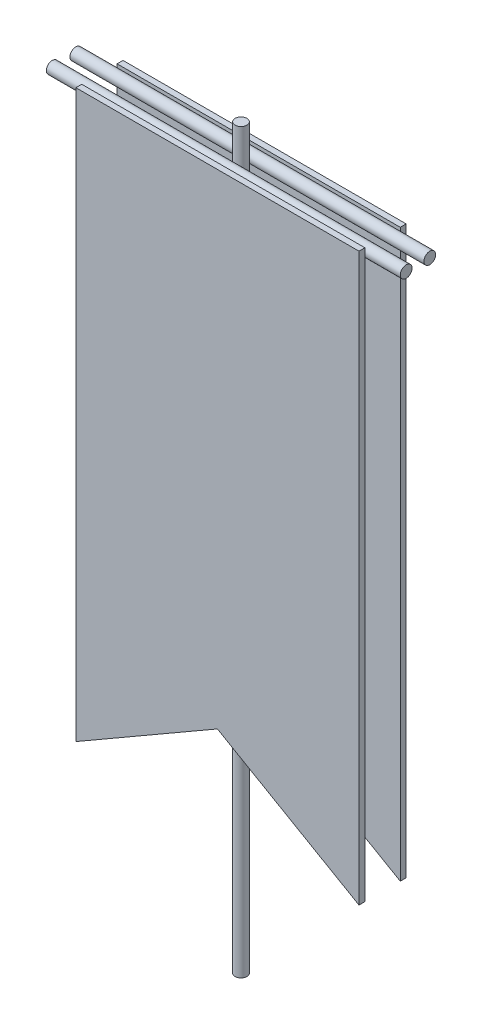
ISO-10303-21;
HEADER;
FILE_DESCRIPTION(('STEP AP214'),'2;1');
FILE_NAME('part.step','',(''),(''),'','','');
FILE_SCHEMA(('AUTOMOTIVE_DESIGN { 1 0 10303 214 1 1 1 1 }'));
ENDSEC;
DATA;
#1=APPLICATION_CONTEXT('core data for automotive mechanical design processes');
#2=APPLICATION_PROTOCOL_DEFINITION('international standard','automotive_design',2000,#1);
#3=PRODUCT_CONTEXT('',#1,'mechanical');
#4=PRODUCT('Part','Part','',(#3));
#5=PRODUCT_RELATED_PRODUCT_CATEGORY('part','',(#4));
#6=PRODUCT_DEFINITION_FORMATION('','',#4);
#7=PRODUCT_DEFINITION_CONTEXT('part definition',#1,'design');
#8=PRODUCT_DEFINITION('design','',#6,#7);
#9=PRODUCT_DEFINITION_SHAPE('','',#8);
#10=(LENGTH_UNIT() NAMED_UNIT(*) SI_UNIT(.MILLI.,.METRE.));
#11=(NAMED_UNIT(*) PLANE_ANGLE_UNIT() SI_UNIT($,.RADIAN.));
#12=(NAMED_UNIT(*) SI_UNIT($,.STERADIAN.) SOLID_ANGLE_UNIT());
#13=UNCERTAINTY_MEASURE_WITH_UNIT(LENGTH_MEASURE(1.E-05),#10,'distance_accuracy_value','');
#14=(GEOMETRIC_REPRESENTATION_CONTEXT(3) GLOBAL_UNCERTAINTY_ASSIGNED_CONTEXT((#13)) GLOBAL_UNIT_ASSIGNED_CONTEXT((#10,
#11,#12)) REPRESENTATION_CONTEXT('',''));
#15=CARTESIAN_POINT('',(0.,0.,0.));
#16=DIRECTION('',(0.,0.,1.));
#17=DIRECTION('',(1.,0.,0.));
#18=AXIS2_PLACEMENT_3D('',#15,#16,#17);
#19=CARTESIAN_POINT('',(0.,641.35,0.));
#20=DIRECTION('',(0.,1.,0.));
#21=DIRECTION('',(0.,0.,1.));
#22=AXIS2_PLACEMENT_3D('',#19,#20,#21);
#23=PLANE('',#22);
#24=CARTESIAN_POINT('',(0.,641.35,0.));
#25=DIRECTION('',(0.,1.,0.));
#26=DIRECTION('',(0.,0.,1.));
#27=AXIS2_PLACEMENT_3D('',#24,#25,#26);
#28=CIRCLE('',#27,6.35);
#29=CARTESIAN_POINT('',(0.,641.35,6.35));
#30=VERTEX_POINT('',#29);
#31=EDGE_CURVE('P0_E18',#30,#30,#28,.F.);
#32=ORIENTED_EDGE('',*,*,#31,.F.);
#33=EDGE_LOOP('',(#32));
#34=FACE_BOUND('',#33,.T.);
#35=ADVANCED_FACE('P0_F15',(#34),#23,.T.);
#36=CARTESIAN_POINT('',(0.,-152.4,0.));
#37=DIRECTION('',(0.,-1.,0.));
#38=DIRECTION('',(0.,0.,-1.));
#39=AXIS2_PLACEMENT_3D('',#36,#37,#38);
#40=PLANE('',#39);
#41=CARTESIAN_POINT('',(0.,-152.4,0.));
#42=DIRECTION('',(0.,1.,0.));
#43=DIRECTION('',(0.,0.,1.));
#44=AXIS2_PLACEMENT_3D('',#41,#42,#43);
#45=CIRCLE('',#44,6.35);
#46=CARTESIAN_POINT('',(0.,-152.4,6.35));
#47=VERTEX_POINT('',#46);
#48=EDGE_CURVE('P0_E10',#47,#47,#45,.T.);
#49=ORIENTED_EDGE('',*,*,#48,.F.);
#50=EDGE_LOOP('',(#49));
#51=FACE_BOUND('',#50,.T.);
#52=ADVANCED_FACE('P0_F30',(#51),#40,.T.);
#53=CARTESIAN_POINT('',(0.,0.,0.));
#54=DIRECTION('',(0.,1.,0.));
#55=DIRECTION('',(0.,0.,1.));
#56=AXIS2_PLACEMENT_3D('',#53,#54,#55);
#57=CYLINDRICAL_SURFACE('',#56,6.35);
#58=ORIENTED_EDGE('',*,*,#48,.T.);
#59=EDGE_LOOP('',(#58));
#60=FACE_BOUND('',#59,.T.);
#61=ORIENTED_EDGE('',*,*,#31,.T.);
#62=EDGE_LOOP('',(#61));
#63=FACE_BOUND('',#62,.T.);
#64=ADVANCED_FACE('P0_F27',(#60,#63),#57,.T.);
#65=CLOSED_SHELL('',(#35,#52,#64));
#66=MANIFOLD_SOLID_BREP('P0_B1',#65);
#67=CARTESIAN_POINT('',(0.,0.,-25.4));
#68=DIRECTION('',(0.,0.,1.));
#69=DIRECTION('',(1.,0.,0.));
#70=AXIS2_PLACEMENT_3D('',#67,#68,#69);
#71=PLANE('',#70);
#72=DIRECTION('',(1.,0.,0.));
#73=VECTOR('',#72,1.);
#74=CARTESIAN_POINT('',(0.,609.6,-25.4));
#75=LINE('',#74,#73);
#76=CARTESIAN_POINT('',(-152.4,609.6,-25.4));
#77=VERTEX_POINT('',#76);
#78=CARTESIAN_POINT('',(152.4,609.6,-25.4));
#79=VERTEX_POINT('',#78);
#80=EDGE_CURVE('P1_E62',#77,#79,#75,.T.);
#81=ORIENTED_EDGE('',*,*,#80,.T.);
#82=DIRECTION('',(0.,1.,0.));
#83=VECTOR('',#82,1.);
#84=CARTESIAN_POINT('',(152.4,0.,-25.4));
#85=LINE('',#84,#83);
#86=CARTESIAN_POINT('',(152.4,4.33680868994202E-13,-25.4));
#87=VERTEX_POINT('',#86);
#88=EDGE_CURVE('P1_E64',#79,#87,#85,.F.);
#89=ORIENTED_EDGE('',*,*,#88,.T.);
#90=DIRECTION('',(-0.866025403784429,0.500000000000017,0.));
#91=VECTOR('',#90,1.);
#92=CARTESIAN_POINT('',(0.,87.9881810245052,-25.4));
#93=LINE('',#92,#91);
#94=CARTESIAN_POINT('',(2.4447980567411E-13,87.9881810245048,-25.4));
#95=VERTEX_POINT('',#94);
#96=EDGE_CURVE('P1_E20',#87,#95,#93,.T.);
#97=ORIENTED_EDGE('',*,*,#96,.T.);
#98=DIRECTION('',(-0.866025403784429,-0.500000000000017,0.));
#99=VECTOR('',#98,1.);
#100=CARTESIAN_POINT('',(-152.4,0.,-25.4));
#101=LINE('',#100,#99);
#102=CARTESIAN_POINT('',(-152.4,0.,-25.4));
#103=VERTEX_POINT('',#102);
#104=EDGE_CURVE('P1_E92',#95,#103,#101,.T.);
#105=ORIENTED_EDGE('',*,*,#104,.T.);
#106=DIRECTION('',(0.,1.,0.));
#107=VECTOR('',#106,1.);
#108=CARTESIAN_POINT('',(-152.4,609.6,-25.4));
#109=LINE('',#108,#107);
#110=EDGE_CURVE('P1_E86',#103,#77,#109,.T.);
#111=ORIENTED_EDGE('',*,*,#110,.T.);
#112=EDGE_LOOP('',(#81,#89,#97,#105,#111));
#113=FACE_BOUND('',#112,.T.);
#114=ADVANCED_FACE('P1_F17',(#113),#71,.F.);
#115=CARTESIAN_POINT('',(0.,87.9881810245052,-19.05));
#116=DIRECTION('',(0.500000000000017,0.866025403784429,0.));
#117=DIRECTION('',(-0.866025403784429,0.500000000000017,0.));
#118=AXIS2_PLACEMENT_3D('',#115,#116,#117);
#119=PLANE('',#118);
#120=ORIENTED_EDGE('',*,*,#96,.F.);
#121=DIRECTION('',(0.,0.,1.));
#122=VECTOR('',#121,1.);
#123=CARTESIAN_POINT('',(152.4,0.,-19.05));
#124=LINE('',#123,#122);
#125=CARTESIAN_POINT('',(152.4,8.67361737988404E-13,-19.05));
#126=VERTEX_POINT('',#125);
#127=EDGE_CURVE('P1_E70',#87,#126,#124,.T.);
#128=ORIENTED_EDGE('',*,*,#127,.T.);
#129=DIRECTION('',(0.866025403784423,-0.500000000000027,0.));
#130=VECTOR('',#129,1.);
#131=CARTESIAN_POINT('',(0.,87.9881810245052,-19.05));
#132=LINE('',#131,#130);
#133=CARTESIAN_POINT('',(2.4980018054066E-13,87.9881810245048,-19.05));
#134=VERTEX_POINT('',#133);
#135=EDGE_CURVE('P1_E95',#134,#126,#132,.T.);
#136=ORIENTED_EDGE('',*,*,#135,.F.);
#137=DIRECTION('',(0.,0.,1.));
#138=VECTOR('',#137,1.);
#139=CARTESIAN_POINT('',(9.99200722162641E-13,87.9881810245035,-19.05));
#140=LINE('',#139,#138);
#141=EDGE_CURVE('P1_E75',#134,#95,#140,.F.);
#142=ORIENTED_EDGE('',*,*,#141,.T.);
#143=EDGE_LOOP('',(#120,#128,#136,#142));
#144=FACE_BOUND('',#143,.T.);
#145=ADVANCED_FACE('P1_F72',(#144),#119,.F.);
#146=CARTESIAN_POINT('',(152.4,0.,-19.05));
#147=DIRECTION('',(-1.,0.,0.));
#148=DIRECTION('',(0.,0.,1.));
#149=AXIS2_PLACEMENT_3D('',#146,#147,#148);
#150=PLANE('',#149);
#151=ORIENTED_EDGE('',*,*,#88,.F.);
#152=DIRECTION('',(0.,0.,-1.));
#153=VECTOR('',#152,1.);
#154=CARTESIAN_POINT('',(152.4,609.6,-19.05));
#155=LINE('',#154,#153);
#156=CARTESIAN_POINT('',(152.4,609.6,-19.05));
#157=VERTEX_POINT('',#156);
#158=EDGE_CURVE('P1_E81',#79,#157,#155,.F.);
#159=ORIENTED_EDGE('',*,*,#158,.T.);
#160=DIRECTION('',(0.,1.,0.));
#161=VECTOR('',#160,1.);
#162=CARTESIAN_POINT('',(152.4,0.,-19.05));
#163=LINE('',#162,#161);
#164=EDGE_CURVE('P1_E79',#126,#157,#163,.T.);
#165=ORIENTED_EDGE('',*,*,#164,.F.);
#166=ORIENTED_EDGE('',*,*,#127,.F.);
#167=EDGE_LOOP('',(#151,#159,#165,#166));
#168=FACE_BOUND('',#167,.T.);
#169=ADVANCED_FACE('P1_F77',(#168),#150,.F.);
#170=CARTESIAN_POINT('',(0.,609.6,-19.05));
#171=DIRECTION('',(0.,-1.,0.));
#172=DIRECTION('',(0.,0.,-1.));
#173=AXIS2_PLACEMENT_3D('',#170,#171,#172);
#174=PLANE('',#173);
#175=ORIENTED_EDGE('',*,*,#80,.F.);
#176=DIRECTION('',(0.,0.,-1.));
#177=VECTOR('',#176,1.);
#178=CARTESIAN_POINT('',(-152.4,609.6,-19.05));
#179=LINE('',#178,#177);
#180=CARTESIAN_POINT('',(-152.4,609.6,-19.05));
#181=VERTEX_POINT('',#180);
#182=EDGE_CURVE('P1_E88',#77,#181,#179,.F.);
#183=ORIENTED_EDGE('',*,*,#182,.T.);
#184=DIRECTION('',(1.,0.,0.));
#185=VECTOR('',#184,1.);
#186=CARTESIAN_POINT('',(0.,609.6,-19.05));
#187=LINE('',#186,#185);
#188=EDGE_CURVE('P1_E98',#157,#181,#187,.F.);
#189=ORIENTED_EDGE('',*,*,#188,.F.);
#190=ORIENTED_EDGE('',*,*,#158,.F.);
#191=EDGE_LOOP('',(#175,#183,#189,#190));
#192=FACE_BOUND('',#191,.T.);
#193=ADVANCED_FACE('P1_F107',(#192),#174,.F.);
#194=CARTESIAN_POINT('',(-152.4,609.6,-19.05));
#195=DIRECTION('',(1.,0.,0.));
#196=DIRECTION('',(0.,0.,-1.));
#197=AXIS2_PLACEMENT_3D('',#194,#195,#196);
#198=PLANE('',#197);
#199=ORIENTED_EDGE('',*,*,#110,.F.);
#200=DIRECTION('',(0.,0.,1.));
#201=VECTOR('',#200,1.);
#202=CARTESIAN_POINT('',(-152.4,0.,-19.05));
#203=LINE('',#202,#201);
#204=CARTESIAN_POINT('',(-152.4,0.,-19.05));
#205=VERTEX_POINT('',#204);
#206=EDGE_CURVE('P1_E35',#103,#205,#203,.T.);
#207=ORIENTED_EDGE('',*,*,#206,.T.);
#208=DIRECTION('',(0.,1.,0.));
#209=VECTOR('',#208,1.);
#210=CARTESIAN_POINT('',(-152.4,0.,-19.05));
#211=LINE('',#210,#209);
#212=EDGE_CURVE('P1_E26',#181,#205,#211,.F.);
#213=ORIENTED_EDGE('',*,*,#212,.F.);
#214=ORIENTED_EDGE('',*,*,#182,.F.);
#215=EDGE_LOOP('',(#199,#207,#213,#214));
#216=FACE_BOUND('',#215,.T.);
#217=ADVANCED_FACE('P1_F105',(#216),#198,.F.);
#218=CARTESIAN_POINT('',(-152.4,0.,-19.05));
#219=DIRECTION('',(-0.500000000000017,0.866025403784429,0.));
#220=DIRECTION('',(-0.866025403784429,-0.500000000000017,0.));
#221=AXIS2_PLACEMENT_3D('',#218,#219,#220);
#222=PLANE('',#221);
#223=ORIENTED_EDGE('',*,*,#104,.F.);
#224=ORIENTED_EDGE('',*,*,#141,.F.);
#225=DIRECTION('',(0.866025403784423,0.500000000000027,0.));
#226=VECTOR('',#225,1.);
#227=CARTESIAN_POINT('',(-152.4,0.,-19.05));
#228=LINE('',#227,#226);
#229=EDGE_CURVE('P1_E11',#205,#134,#228,.T.);
#230=ORIENTED_EDGE('',*,*,#229,.F.);
#231=ORIENTED_EDGE('',*,*,#206,.F.);
#232=EDGE_LOOP('',(#223,#224,#230,#231));
#233=FACE_BOUND('',#232,.T.);
#234=ADVANCED_FACE('P1_F109',(#233),#222,.F.);
#235=CARTESIAN_POINT('',(0.,0.,-19.05));
#236=DIRECTION('',(0.,0.,1.));
#237=DIRECTION('',(1.,0.,0.));
#238=AXIS2_PLACEMENT_3D('',#235,#236,#237);
#239=PLANE('',#238);
#240=ORIENTED_EDGE('',*,*,#212,.T.);
#241=ORIENTED_EDGE('',*,*,#229,.T.);
#242=ORIENTED_EDGE('',*,*,#135,.T.);
#243=ORIENTED_EDGE('',*,*,#164,.T.);
#244=ORIENTED_EDGE('',*,*,#188,.T.);
#245=EDGE_LOOP('',(#240,#241,#242,#243,#244));
#246=FACE_BOUND('',#245,.T.);
#247=ADVANCED_FACE('P1_F102',(#246),#239,.T.);
#248=CLOSED_SHELL('',(#114,#145,#169,#193,#217,#234,#247));
#249=MANIFOLD_SOLID_BREP('P1_B1',#248);
#250=CARTESIAN_POINT('',(190.5,0.,0.));
#251=DIRECTION('',(-1.,0.,0.));
#252=DIRECTION('',(0.,0.,1.));
#253=AXIS2_PLACEMENT_3D('',#250,#251,#252);
#254=PLANE('',#253);
#255=CARTESIAN_POINT('',(190.5,603.25,-12.7));
#256=DIRECTION('',(-1.,0.,0.));
#257=DIRECTION('',(0.,0.,1.));
#258=AXIS2_PLACEMENT_3D('',#255,#256,#257);
#259=CIRCLE('',#258,6.35);
#260=CARTESIAN_POINT('',(190.5,603.25,-6.35));
#261=VERTEX_POINT('',#260);
#262=EDGE_CURVE('P2_E18',#261,#261,#259,.T.);
#263=ORIENTED_EDGE('',*,*,#262,.F.);
#264=EDGE_LOOP('',(#263));
#265=FACE_BOUND('',#264,.T.);
#266=ADVANCED_FACE('P2_F15',(#265),#254,.F.);
#267=CARTESIAN_POINT('',(-190.5,0.,0.));
#268=DIRECTION('',(-1.,0.,0.));
#269=DIRECTION('',(0.,0.,1.));
#270=AXIS2_PLACEMENT_3D('',#267,#268,#269);
#271=PLANE('',#270);
#272=CARTESIAN_POINT('',(-190.5,603.25,-12.7));
#273=DIRECTION('',(-1.,0.,0.));
#274=DIRECTION('',(0.,0.,1.));
#275=AXIS2_PLACEMENT_3D('',#272,#273,#274);
#276=CIRCLE('',#275,6.35);
#277=CARTESIAN_POINT('',(-190.5,603.25,-6.35));
#278=VERTEX_POINT('',#277);
#279=EDGE_CURVE('P2_E10',#278,#278,#276,.F.);
#280=ORIENTED_EDGE('',*,*,#279,.F.);
#281=EDGE_LOOP('',(#280));
#282=FACE_BOUND('',#281,.T.);
#283=ADVANCED_FACE('P2_F30',(#282),#271,.T.);
#284=CARTESIAN_POINT('',(-190.5,603.25,-12.7));
#285=DIRECTION('',(-1.,0.,0.));
#286=DIRECTION('',(0.,0.,1.));
#287=AXIS2_PLACEMENT_3D('',#284,#285,#286);
#288=CYLINDRICAL_SURFACE('',#287,6.35);
#289=ORIENTED_EDGE('',*,*,#262,.T.);
#290=EDGE_LOOP('',(#289));
#291=FACE_BOUND('',#290,.T.);
#292=ORIENTED_EDGE('',*,*,#279,.T.);
#293=EDGE_LOOP('',(#292));
#294=FACE_BOUND('',#293,.T.);
#295=ADVANCED_FACE('P2_F27',(#291,#294),#288,.T.);
#296=CLOSED_SHELL('',(#266,#283,#295));
#297=MANIFOLD_SOLID_BREP('P2_B1',#296);
#298=CARTESIAN_POINT('',(0.,0.,25.4));
#299=DIRECTION('',(0.,0.,1.));
#300=DIRECTION('',(1.,0.,0.));
#301=AXIS2_PLACEMENT_3D('',#298,#299,#300);
#302=PLANE('',#301);
#303=DIRECTION('',(0.,1.,0.));
#304=VECTOR('',#303,1.);
#305=CARTESIAN_POINT('',(-152.4,609.6,25.4));
#306=LINE('',#305,#304);
#307=CARTESIAN_POINT('',(-152.4,0.,25.4));
#308=VERTEX_POINT('',#307);
#309=CARTESIAN_POINT('',(-152.4,609.6,25.4));
#310=VERTEX_POINT('',#309);
#311=EDGE_CURVE('P3_E76',#308,#310,#306,.T.);
#312=ORIENTED_EDGE('',*,*,#311,.F.);
#313=DIRECTION('',(0.866025403784429,0.500000000000017,0.));
#314=VECTOR('',#313,1.);
#315=CARTESIAN_POINT('',(-152.4,0.,25.4));
#316=LINE('',#315,#314);
#317=CARTESIAN_POINT('',(2.4980018054066E-13,87.9881810245048,25.4));
#318=VERTEX_POINT('',#317);
#319=EDGE_CURVE('P3_E20',#318,#308,#316,.F.);
#320=ORIENTED_EDGE('',*,*,#319,.F.);
#321=DIRECTION('',(0.866025403784429,-0.500000000000017,0.));
#322=VECTOR('',#321,1.);
#323=CARTESIAN_POINT('',(0.,87.9881810245052,25.4));
#324=LINE('',#323,#322);
#325=CARTESIAN_POINT('',(152.4,4.33680868994202E-13,25.4));
#326=VERTEX_POINT('',#325);
#327=EDGE_CURVE('P3_E65',#326,#318,#324,.F.);
#328=ORIENTED_EDGE('',*,*,#327,.F.);
#329=DIRECTION('',(0.,1.,0.));
#330=VECTOR('',#329,1.);
#331=CARTESIAN_POINT('',(152.4,0.,25.4));
#332=LINE('',#331,#330);
#333=CARTESIAN_POINT('',(152.4,609.6,25.4));
#334=VERTEX_POINT('',#333);
#335=EDGE_CURVE('P3_E60',#334,#326,#332,.F.);
#336=ORIENTED_EDGE('',*,*,#335,.F.);
#337=DIRECTION('',(1.,0.,0.));
#338=VECTOR('',#337,1.);
#339=CARTESIAN_POINT('',(0.,609.6,25.4));
#340=LINE('',#339,#338);
#341=EDGE_CURVE('P3_E89',#310,#334,#340,.T.);
#342=ORIENTED_EDGE('',*,*,#341,.F.);
#343=EDGE_LOOP('',(#312,#320,#328,#336,#342));
#344=FACE_BOUND('',#343,.T.);
#345=ADVANCED_FACE('P3_F17',(#344),#302,.T.);
#346=CARTESIAN_POINT('',(-152.4,0.,19.05));
#347=DIRECTION('',(0.500000000000017,-0.866025403784429,0.));
#348=DIRECTION('',(0.866025403784429,0.500000000000017,0.));
#349=AXIS2_PLACEMENT_3D('',#346,#347,#348);
#350=PLANE('',#349);
#351=DIRECTION('',(0.,0.,1.));
#352=VECTOR('',#351,1.);
#353=CARTESIAN_POINT('',(-152.4,0.,19.05));
#354=LINE('',#353,#352);
#355=CARTESIAN_POINT('',(-152.4,0.,19.05));
#356=VERTEX_POINT('',#355);
#357=EDGE_CURVE('P3_E91',#356,#308,#354,.T.);
#358=ORIENTED_EDGE('',*,*,#357,.F.);
#359=DIRECTION('',(0.866025403784423,0.500000000000027,0.));
#360=VECTOR('',#359,1.);
#361=CARTESIAN_POINT('',(-152.4,0.,19.05));
#362=LINE('',#361,#360);
#363=CARTESIAN_POINT('',(4.9427998621477E-13,87.9881810245043,19.05));
#364=VERTEX_POINT('',#363);
#365=EDGE_CURVE('P3_E82',#356,#364,#362,.T.);
#366=ORIENTED_EDGE('',*,*,#365,.T.);
#367=DIRECTION('',(0.,0.,1.));
#368=VECTOR('',#367,1.);
#369=CARTESIAN_POINT('',(0.,87.9881810245052,19.05));
#370=LINE('',#369,#368);
#371=EDGE_CURVE('P3_E70',#318,#364,#370,.F.);
#372=ORIENTED_EDGE('',*,*,#371,.F.);
#373=ORIENTED_EDGE('',*,*,#319,.T.);
#374=EDGE_LOOP('',(#358,#366,#372,#373));
#375=FACE_BOUND('',#374,.T.);
#376=ADVANCED_FACE('P3_F81',(#375),#350,.T.);
#377=CARTESIAN_POINT('',(0.,87.9881810245052,19.05));
#378=DIRECTION('',(-0.500000000000017,-0.866025403784429,0.));
#379=DIRECTION('',(0.866025403784429,-0.500000000000017,0.));
#380=AXIS2_PLACEMENT_3D('',#377,#378,#379);
#381=PLANE('',#380);
#382=ORIENTED_EDGE('',*,*,#371,.T.);
#383=DIRECTION('',(0.866025403784423,-0.500000000000027,0.));
#384=VECTOR('',#383,1.);
#385=CARTESIAN_POINT('',(0.,87.9881810245052,19.05));
#386=LINE('',#385,#384);
#387=CARTESIAN_POINT('',(152.4,8.67361737988404E-13,19.05));
#388=VERTEX_POINT('',#387);
#389=EDGE_CURVE('P3_E97',#364,#388,#386,.T.);
#390=ORIENTED_EDGE('',*,*,#389,.T.);
#391=DIRECTION('',(0.,0.,-1.));
#392=VECTOR('',#391,1.);
#393=CARTESIAN_POINT('',(152.4,0.,19.05));
#394=LINE('',#393,#392);
#395=EDGE_CURVE('P3_E72',#326,#388,#394,.T.);
#396=ORIENTED_EDGE('',*,*,#395,.F.);
#397=ORIENTED_EDGE('',*,*,#327,.T.);
#398=EDGE_LOOP('',(#382,#390,#396,#397));
#399=FACE_BOUND('',#398,.T.);
#400=ADVANCED_FACE('P3_F67',(#399),#381,.T.);
#401=CARTESIAN_POINT('',(152.4,0.,19.05));
#402=DIRECTION('',(1.,0.,0.));
#403=DIRECTION('',(0.,0.,-1.));
#404=AXIS2_PLACEMENT_3D('',#401,#402,#403);
#405=PLANE('',#404);
#406=ORIENTED_EDGE('',*,*,#395,.T.);
#407=DIRECTION('',(0.,1.,0.));
#408=VECTOR('',#407,1.);
#409=CARTESIAN_POINT('',(152.4,0.,19.05));
#410=LINE('',#409,#408);
#411=CARTESIAN_POINT('',(152.4,609.6,19.05));
#412=VERTEX_POINT('',#411);
#413=EDGE_CURVE('P3_E99',#388,#412,#410,.T.);
#414=ORIENTED_EDGE('',*,*,#413,.T.);
#415=DIRECTION('',(0.,0.,1.));
#416=VECTOR('',#415,1.);
#417=CARTESIAN_POINT('',(152.4,609.6,19.05));
#418=LINE('',#417,#416);
#419=EDGE_CURVE('P3_E87',#334,#412,#418,.F.);
#420=ORIENTED_EDGE('',*,*,#419,.F.);
#421=ORIENTED_EDGE('',*,*,#335,.T.);
#422=EDGE_LOOP('',(#406,#414,#420,#421));
#423=FACE_BOUND('',#422,.T.);
#424=ADVANCED_FACE('P3_F103',(#423),#405,.T.);
#425=CARTESIAN_POINT('',(0.,609.6,19.05));
#426=DIRECTION('',(0.,1.,0.));
#427=DIRECTION('',(0.,0.,1.));
#428=AXIS2_PLACEMENT_3D('',#425,#426,#427);
#429=PLANE('',#428);
#430=ORIENTED_EDGE('',*,*,#341,.T.);
#431=ORIENTED_EDGE('',*,*,#419,.T.);
#432=DIRECTION('',(1.,0.,0.));
#433=VECTOR('',#432,1.);
#434=CARTESIAN_POINT('',(0.,609.6,19.05));
#435=LINE('',#434,#433);
#436=CARTESIAN_POINT('',(-152.4,609.6,19.05));
#437=VERTEX_POINT('',#436);
#438=EDGE_CURVE('P3_E26',#412,#437,#435,.F.);
#439=ORIENTED_EDGE('',*,*,#438,.T.);
#440=DIRECTION('',(0.,0.,1.));
#441=VECTOR('',#440,1.);
#442=CARTESIAN_POINT('',(-152.4,609.6,19.05));
#443=LINE('',#442,#441);
#444=EDGE_CURVE('P3_E94',#310,#437,#443,.F.);
#445=ORIENTED_EDGE('',*,*,#444,.F.);
#446=EDGE_LOOP('',(#430,#431,#439,#445));
#447=FACE_BOUND('',#446,.T.);
#448=ADVANCED_FACE('P3_F109',(#447),#429,.T.);
#449=CARTESIAN_POINT('',(-152.4,609.6,19.05));
#450=DIRECTION('',(-1.,0.,0.));
#451=DIRECTION('',(0.,0.,1.));
#452=AXIS2_PLACEMENT_3D('',#449,#450,#451);
#453=PLANE('',#452);
#454=ORIENTED_EDGE('',*,*,#444,.T.);
#455=DIRECTION('',(0.,1.,0.));
#456=VECTOR('',#455,1.);
#457=CARTESIAN_POINT('',(-152.4,0.,19.05));
#458=LINE('',#457,#456);
#459=EDGE_CURVE('P3_E11',#437,#356,#458,.F.);
#460=ORIENTED_EDGE('',*,*,#459,.T.);
#461=ORIENTED_EDGE('',*,*,#357,.T.);
#462=ORIENTED_EDGE('',*,*,#311,.T.);
#463=EDGE_LOOP('',(#454,#460,#461,#462));
#464=FACE_BOUND('',#463,.T.);
#465=ADVANCED_FACE('P3_F108',(#464),#453,.T.);
#466=CARTESIAN_POINT('',(0.,0.,19.05));
#467=DIRECTION('',(0.,0.,1.));
#468=DIRECTION('',(1.,0.,0.));
#469=AXIS2_PLACEMENT_3D('',#466,#467,#468);
#470=PLANE('',#469);
#471=ORIENTED_EDGE('',*,*,#459,.F.);
#472=ORIENTED_EDGE('',*,*,#438,.F.);
#473=ORIENTED_EDGE('',*,*,#413,.F.);
#474=ORIENTED_EDGE('',*,*,#389,.F.);
#475=ORIENTED_EDGE('',*,*,#365,.F.);
#476=EDGE_LOOP('',(#471,#472,#473,#474,#475));
#477=FACE_BOUND('',#476,.T.);
#478=ADVANCED_FACE('P3_F106',(#477),#470,.F.);
#479=CLOSED_SHELL('',(#345,#376,#400,#424,#448,#465,#478));
#480=MANIFOLD_SOLID_BREP('P3_B1',#479);
#481=CARTESIAN_POINT('',(190.5,0.,0.));
#482=DIRECTION('',(1.,0.,0.));
#483=DIRECTION('',(0.,0.,-1.));
#484=AXIS2_PLACEMENT_3D('',#481,#482,#483);
#485=PLANE('',#484);
#486=CARTESIAN_POINT('',(190.5,603.25,12.7));
#487=DIRECTION('',(1.,0.,0.));
#488=DIRECTION('',(0.,0.,-1.));
#489=AXIS2_PLACEMENT_3D('',#486,#487,#488);
#490=CIRCLE('',#489,6.35);
#491=CARTESIAN_POINT('',(190.5,603.25,6.35));
#492=VERTEX_POINT('',#491);
#493=EDGE_CURVE('P4_E18',#492,#492,#490,.F.);
#494=ORIENTED_EDGE('',*,*,#493,.F.);
#495=EDGE_LOOP('',(#494));
#496=FACE_BOUND('',#495,.T.);
#497=ADVANCED_FACE('P4_F15',(#496),#485,.T.);
#498=CARTESIAN_POINT('',(-190.5,0.,0.));
#499=DIRECTION('',(1.,0.,0.));
#500=DIRECTION('',(0.,0.,-1.));
#501=AXIS2_PLACEMENT_3D('',#498,#499,#500);
#502=PLANE('',#501);
#503=CARTESIAN_POINT('',(-190.5,603.25,12.7));
#504=DIRECTION('',(1.,0.,0.));
#505=DIRECTION('',(0.,0.,-1.));
#506=AXIS2_PLACEMENT_3D('',#503,#504,#505);
#507=CIRCLE('',#506,6.35);
#508=CARTESIAN_POINT('',(-190.5,603.25,6.35));
#509=VERTEX_POINT('',#508);
#510=EDGE_CURVE('P4_E10',#509,#509,#507,.T.);
#511=ORIENTED_EDGE('',*,*,#510,.F.);
#512=EDGE_LOOP('',(#511));
#513=FACE_BOUND('',#512,.T.);
#514=ADVANCED_FACE('P4_F30',(#513),#502,.F.);
#515=CARTESIAN_POINT('',(-190.5,603.25,12.7));
#516=DIRECTION('',(1.,0.,0.));
#517=DIRECTION('',(0.,0.,-1.));
#518=AXIS2_PLACEMENT_3D('',#515,#516,#517);
#519=CYLINDRICAL_SURFACE('',#518,6.35);
#520=ORIENTED_EDGE('',*,*,#493,.T.);
#521=EDGE_LOOP('',(#520));
#522=FACE_BOUND('',#521,.T.);
#523=ORIENTED_EDGE('',*,*,#510,.T.);
#524=EDGE_LOOP('',(#523));
#525=FACE_BOUND('',#524,.T.);
#526=ADVANCED_FACE('P4_F27',(#522,#525),#519,.T.);
#527=CLOSED_SHELL('',(#497,#514,#526));
#528=MANIFOLD_SOLID_BREP('P4_B1',#527);
#529=ADVANCED_BREP_SHAPE_REPRESENTATION('',(#18,#66,#249,#297,#480,#528),#14);
#530=SHAPE_DEFINITION_REPRESENTATION(#9,#529);
ENDSEC;
END-ISO-10303-21;
